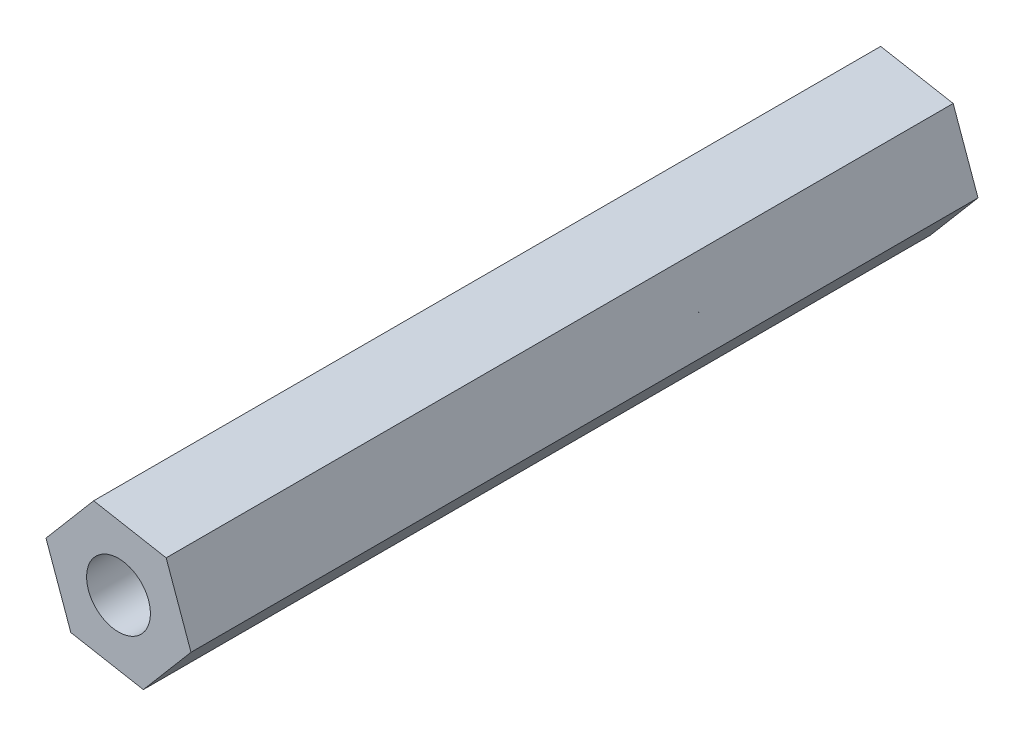
ISO-10303-21;
HEADER;
FILE_DESCRIPTION(('STEP AP214'),'2;1');
FILE_NAME('part.step','',(''),(''),'','','');
FILE_SCHEMA(('AUTOMOTIVE_DESIGN { 1 0 10303 214 1 1 1 1 }'));
ENDSEC;
DATA;
#1=APPLICATION_CONTEXT('core data for automotive mechanical design processes');
#2=APPLICATION_PROTOCOL_DEFINITION('international standard','automotive_design',2000,#1);
#3=PRODUCT_CONTEXT('',#1,'mechanical');
#4=PRODUCT('Part','Part','',(#3));
#5=PRODUCT_RELATED_PRODUCT_CATEGORY('part','',(#4));
#6=PRODUCT_DEFINITION_FORMATION('','',#4);
#7=PRODUCT_DEFINITION_CONTEXT('part definition',#1,'design');
#8=PRODUCT_DEFINITION('design','',#6,#7);
#9=PRODUCT_DEFINITION_SHAPE('','',#8);
#10=(LENGTH_UNIT() NAMED_UNIT(*) SI_UNIT(.MILLI.,.METRE.));
#11=(NAMED_UNIT(*) PLANE_ANGLE_UNIT() SI_UNIT($,.RADIAN.));
#12=(NAMED_UNIT(*) SI_UNIT($,.STERADIAN.) SOLID_ANGLE_UNIT());
#13=UNCERTAINTY_MEASURE_WITH_UNIT(LENGTH_MEASURE(1.E-05),#10,'distance_accuracy_value','');
#14=(GEOMETRIC_REPRESENTATION_CONTEXT(3) GLOBAL_UNCERTAINTY_ASSIGNED_CONTEXT((#13)) GLOBAL_UNIT_ASSIGNED_CONTEXT((#10,
#11,#12)) REPRESENTATION_CONTEXT('',''));
#15=CARTESIAN_POINT('',(0.,0.,0.));
#16=DIRECTION('',(0.,0.,1.));
#17=DIRECTION('',(1.,0.,0.));
#18=AXIS2_PLACEMENT_3D('',#15,#16,#17);
#19=CARTESIAN_POINT('',(14.100105118259,-7.40552271774973,37.));
#20=DIRECTION('',(-0.941553473498977,-0.336863557753005,0.));
#21=DIRECTION('',(0.336863557753005,-0.941553473498977,0.));
#22=AXIS2_PLACEMENT_3D('',#19,#20,#21);
#23=PLANE('',#22);
#24=DIRECTION('',(-0.336863557753005,0.941553473498977,0.));
#25=VECTOR('',#24,1.);
#26=CARTESIAN_POINT('',(14.100105118259,-7.40552271774973,0.));
#27=LINE('',#26,#25);
#28=CARTESIAN_POINT('',(14.100105118259,-7.40552271774973,0.));
#29=VERTEX_POINT('',#28);
#30=CARTESIAN_POINT('',(12.9331755237658,-4.14388580946336,0.));
#31=VERTEX_POINT('',#30);
#32=EDGE_CURVE('E117',#29,#31,#27,.T.);
#33=ORIENTED_EDGE('',*,*,#32,.T.);
#34=DIRECTION('',(0.,0.,-1.));
#35=VECTOR('',#34,1.);
#36=CARTESIAN_POINT('',(12.9331755237658,-4.14388580946336,37.));
#37=LINE('',#36,#35);
#38=CARTESIAN_POINT('',(12.9331755237658,-4.14388580946336,37.));
#39=VERTEX_POINT('',#38);
#40=EDGE_CURVE('E11',#39,#31,#37,.T.);
#41=ORIENTED_EDGE('',*,*,#40,.F.);
#42=DIRECTION('',(-0.336863557753005,0.941553473498977,0.));
#43=VECTOR('',#42,1.);
#44=CARTESIAN_POINT('',(14.100105118259,-7.40552271774973,37.));
#45=LINE('',#44,#43);
#46=CARTESIAN_POINT('',(14.100105118259,-7.40552271774973,37.));
#47=VERTEX_POINT('',#46);
#48=EDGE_CURVE('E128',#47,#39,#45,.T.);
#49=ORIENTED_EDGE('',*,*,#48,.F.);
#50=DIRECTION('',(0.,0.,-1.));
#51=VECTOR('',#50,1.);
#52=CARTESIAN_POINT('',(14.100105118259,-7.40552271774973,37.));
#53=LINE('',#52,#51);
#54=EDGE_CURVE('E113',#47,#29,#53,.T.);
#55=ORIENTED_EDGE('',*,*,#54,.T.);
#56=EDGE_LOOP('',(#33,#41,#49,#55));
#57=FACE_BOUND('',#56,.T.);
#58=ADVANCED_FACE('F33',(#57),#23,.F.);
#59=CARTESIAN_POINT('',(12.9331755237658,-4.14388580946336,37.));
#60=DIRECTION('',(-0.17904433812618,-0.983841005948094,0.));
#61=DIRECTION('',(0.983841005948094,-0.17904433812618,0.));
#62=AXIS2_PLACEMENT_3D('',#59,#60,#61);
#63=PLANE('',#62);
#64=DIRECTION('',(-0.983841005948094,0.17904433812618,0.));
#65=VECTOR('',#64,1.);
#66=CARTESIAN_POINT('',(12.9331755237658,-4.14388580946336,0.));
#67=LINE('',#66,#65);
#68=CARTESIAN_POINT('',(9.52505030602222,-3.52365802857919,0.));
#69=VERTEX_POINT('',#68);
#70=EDGE_CURVE('E120',#31,#69,#67,.T.);
#71=ORIENTED_EDGE('',*,*,#70,.T.);
#72=DIRECTION('',(0.,0.,-1.));
#73=VECTOR('',#72,1.);
#74=CARTESIAN_POINT('',(9.52505030602222,-3.52365802857919,37.));
#75=LINE('',#74,#73);
#76=CARTESIAN_POINT('',(9.52505030602222,-3.52365802857919,37.));
#77=VERTEX_POINT('',#76);
#78=EDGE_CURVE('E41',#77,#69,#75,.T.);
#79=ORIENTED_EDGE('',*,*,#78,.F.);
#80=DIRECTION('',(-0.983841005948094,0.17904433812618,0.));
#81=VECTOR('',#80,1.);
#82=CARTESIAN_POINT('',(12.9331755237658,-4.14388580946336,37.));
#83=LINE('',#82,#81);
#84=EDGE_CURVE('E86',#39,#77,#83,.T.);
#85=ORIENTED_EDGE('',*,*,#84,.F.);
#86=ORIENTED_EDGE('',*,*,#40,.T.);
#87=EDGE_LOOP('',(#71,#79,#85,#86));
#88=FACE_BOUND('',#87,.T.);
#89=ADVANCED_FACE('F153',(#88),#63,.F.);
#90=CARTESIAN_POINT('',(9.52505030602222,-3.52365802857919,37.));
#91=DIRECTION('',(0.762509135372797,-0.64697744819509,0.));
#92=DIRECTION('',(0.64697744819509,0.762509135372797,0.));
#93=AXIS2_PLACEMENT_3D('',#90,#91,#92);
#94=PLANE('',#93);
#95=DIRECTION('',(-0.64697744819509,-0.762509135372797,0.));
#96=VECTOR('',#95,1.);
#97=CARTESIAN_POINT('',(9.52505030602222,-3.52365802857919,0.));
#98=LINE('',#97,#96);
#99=CARTESIAN_POINT('',(7.28385468277191,-6.16506715598138,0.));
#100=VERTEX_POINT('',#99);
#101=EDGE_CURVE('E123',#69,#100,#98,.T.);
#102=ORIENTED_EDGE('',*,*,#101,.T.);
#103=DIRECTION('',(0.,0.,-1.));
#104=VECTOR('',#103,1.);
#105=CARTESIAN_POINT('',(7.28385468277191,-6.16506715598138,37.));
#106=LINE('',#105,#104);
#107=CARTESIAN_POINT('',(7.28385468277191,-6.16506715598138,37.));
#108=VERTEX_POINT('',#107);
#109=EDGE_CURVE('E108',#108,#100,#106,.T.);
#110=ORIENTED_EDGE('',*,*,#109,.F.);
#111=DIRECTION('',(-0.64697744819509,-0.762509135372797,0.));
#112=VECTOR('',#111,1.);
#113=CARTESIAN_POINT('',(9.52505030602222,-3.52365802857919,37.));
#114=LINE('',#113,#112);
#115=EDGE_CURVE('E99',#77,#108,#114,.T.);
#116=ORIENTED_EDGE('',*,*,#115,.F.);
#117=ORIENTED_EDGE('',*,*,#78,.T.);
#118=EDGE_LOOP('',(#102,#110,#116,#117));
#119=FACE_BOUND('',#118,.T.);
#120=ADVANCED_FACE('F134',(#119),#94,.F.);
#121=CARTESIAN_POINT('',(7.28385468277191,-6.16506715598138,37.));
#122=DIRECTION('',(0.941553473498977,0.336863557753005,0.));
#123=DIRECTION('',(-0.336863557753005,0.941553473498977,0.));
#124=AXIS2_PLACEMENT_3D('',#121,#122,#123);
#125=PLANE('',#124);
#126=DIRECTION('',(0.336863557753005,-0.941553473498977,0.));
#127=VECTOR('',#126,1.);
#128=CARTESIAN_POINT('',(7.28385468277191,-6.16506715598138,0.));
#129=LINE('',#128,#127);
#130=CARTESIAN_POINT('',(8.45078427726515,-9.42670406426776,0.));
#131=VERTEX_POINT('',#130);
#132=EDGE_CURVE('E107',#100,#131,#129,.T.);
#133=ORIENTED_EDGE('',*,*,#132,.T.);
#134=DIRECTION('',(0.,0.,-1.));
#135=VECTOR('',#134,1.);
#136=CARTESIAN_POINT('',(8.45078427726515,-9.42670406426776,37.));
#137=LINE('',#136,#135);
#138=CARTESIAN_POINT('',(8.45078427726515,-9.42670406426776,37.));
#139=VERTEX_POINT('',#138);
#140=EDGE_CURVE('E104',#139,#131,#137,.T.);
#141=ORIENTED_EDGE('',*,*,#140,.F.);
#142=DIRECTION('',(0.336863557753005,-0.941553473498977,0.));
#143=VECTOR('',#142,1.);
#144=CARTESIAN_POINT('',(7.28385468277191,-6.16506715598138,37.));
#145=LINE('',#144,#143);
#146=EDGE_CURVE('E93',#108,#139,#145,.T.);
#147=ORIENTED_EDGE('',*,*,#146,.F.);
#148=ORIENTED_EDGE('',*,*,#109,.T.);
#149=EDGE_LOOP('',(#133,#141,#147,#148));
#150=FACE_BOUND('',#149,.T.);
#151=ADVANCED_FACE('F105',(#150),#125,.F.);
#152=CARTESIAN_POINT('',(8.45078427726515,-9.42670406426776,37.));
#153=DIRECTION('',(0.17904433812618,0.983841005948094,0.));
#154=DIRECTION('',(-0.983841005948094,0.17904433812618,0.));
#155=AXIS2_PLACEMENT_3D('',#152,#153,#154);
#156=PLANE('',#155);
#157=DIRECTION('',(0.983841005948094,-0.17904433812618,0.));
#158=VECTOR('',#157,1.);
#159=CARTESIAN_POINT('',(8.45078427726515,-9.42670406426776,0.));
#160=LINE('',#159,#158);
#161=CARTESIAN_POINT('',(11.8589094950087,-10.0469318451519,0.));
#162=VERTEX_POINT('',#161);
#163=EDGE_CURVE('E72',#131,#162,#160,.T.);
#164=ORIENTED_EDGE('',*,*,#163,.T.);
#165=DIRECTION('',(0.,0.,-1.));
#166=VECTOR('',#165,1.);
#167=CARTESIAN_POINT('',(11.8589094950087,-10.0469318451519,37.));
#168=LINE('',#167,#166);
#169=CARTESIAN_POINT('',(11.8589094950087,-10.0469318451519,37.));
#170=VERTEX_POINT('',#169);
#171=EDGE_CURVE('E109',#170,#162,#168,.T.);
#172=ORIENTED_EDGE('',*,*,#171,.F.);
#173=DIRECTION('',(0.983841005948094,-0.17904433812618,0.));
#174=VECTOR('',#173,1.);
#175=CARTESIAN_POINT('',(8.45078427726515,-9.42670406426776,37.));
#176=LINE('',#175,#174);
#177=EDGE_CURVE('E97',#139,#170,#176,.T.);
#178=ORIENTED_EDGE('',*,*,#177,.F.);
#179=ORIENTED_EDGE('',*,*,#140,.T.);
#180=EDGE_LOOP('',(#164,#172,#178,#179));
#181=FACE_BOUND('',#180,.T.);
#182=ADVANCED_FACE('F111',(#181),#156,.F.);
#183=CARTESIAN_POINT('',(11.8589094950087,-10.0469318451519,37.));
#184=DIRECTION('',(-0.762509135372797,0.64697744819509,0.));
#185=DIRECTION('',(-0.64697744819509,-0.762509135372797,0.));
#186=AXIS2_PLACEMENT_3D('',#183,#184,#185);
#187=PLANE('',#186);
#188=DIRECTION('',(0.64697744819509,0.762509135372797,0.));
#189=VECTOR('',#188,1.);
#190=CARTESIAN_POINT('',(11.8589094950087,-10.0469318451519,0.));
#191=LINE('',#190,#189);
#192=EDGE_CURVE('E78',#162,#29,#191,.T.);
#193=ORIENTED_EDGE('',*,*,#192,.T.);
#194=ORIENTED_EDGE('',*,*,#54,.F.);
#195=DIRECTION('',(0.64697744819509,0.762509135372797,0.));
#196=VECTOR('',#195,1.);
#197=CARTESIAN_POINT('',(11.8589094950087,-10.0469318451519,37.));
#198=LINE('',#197,#196);
#199=EDGE_CURVE('E49',#170,#47,#198,.T.);
#200=ORIENTED_EDGE('',*,*,#199,.F.);
#201=ORIENTED_EDGE('',*,*,#171,.T.);
#202=EDGE_LOOP('',(#193,#194,#200,#201));
#203=FACE_BOUND('',#202,.T.);
#204=ADVANCED_FACE('F141',(#203),#187,.F.);
#205=CARTESIAN_POINT('',(0.,0.,37.));
#206=DIRECTION('',(0.,0.,1.));
#207=DIRECTION('',(1.,0.,0.));
#208=AXIS2_PLACEMENT_3D('',#205,#206,#207);
#209=PLANE('',#208);
#210=CARTESIAN_POINT('',(10.6919799005155,-6.78529493686556,37.));
#211=DIRECTION('',(0.,0.,1.));
#212=DIRECTION('',(1.,0.,0.));
#213=AXIS2_PLACEMENT_3D('',#210,#211,#212);
#214=CIRCLE('',#213,1.5);
#215=CARTESIAN_POINT('',(12.1919799005155,-6.78529493686556,37.));
#216=VERTEX_POINT('',#215);
#217=EDGE_CURVE('E121',#216,#216,#214,.T.);
#218=ORIENTED_EDGE('',*,*,#217,.F.);
#219=EDGE_LOOP('',(#218));
#220=FACE_BOUND('',#219,.T.);
#221=ORIENTED_EDGE('',*,*,#48,.T.);
#222=ORIENTED_EDGE('',*,*,#84,.T.);
#223=ORIENTED_EDGE('',*,*,#115,.T.);
#224=ORIENTED_EDGE('',*,*,#146,.T.);
#225=ORIENTED_EDGE('',*,*,#177,.T.);
#226=ORIENTED_EDGE('',*,*,#199,.T.);
#227=EDGE_LOOP('',(#221,#222,#223,#224,#225,#226));
#228=FACE_BOUND('',#227,.T.);
#229=ADVANCED_FACE('F95',(#220,#228),#209,.T.);
#230=CARTESIAN_POINT('',(0.,0.,0.));
#231=DIRECTION('',(0.,0.,1.));
#232=DIRECTION('',(1.,0.,0.));
#233=AXIS2_PLACEMENT_3D('',#230,#231,#232);
#234=PLANE('',#233);
#235=CARTESIAN_POINT('',(10.6919799005155,-6.78529493686556,0.));
#236=DIRECTION('',(0.,0.,-1.));
#237=DIRECTION('',(-1.,0.,0.));
#238=AXIS2_PLACEMENT_3D('',#235,#236,#237);
#239=CIRCLE('',#238,1.5);
#240=CARTESIAN_POINT('',(9.19197990051546,-6.78529493686556,0.));
#241=VERTEX_POINT('',#240);
#242=EDGE_CURVE('E208',#241,#241,#239,.T.);
#243=ORIENTED_EDGE('',*,*,#242,.F.);
#244=EDGE_LOOP('',(#243));
#245=FACE_BOUND('',#244,.T.);
#246=ORIENTED_EDGE('',*,*,#32,.F.);
#247=ORIENTED_EDGE('',*,*,#192,.F.);
#248=ORIENTED_EDGE('',*,*,#163,.F.);
#249=ORIENTED_EDGE('',*,*,#132,.F.);
#250=ORIENTED_EDGE('',*,*,#101,.F.);
#251=ORIENTED_EDGE('',*,*,#70,.F.);
#252=EDGE_LOOP('',(#246,#247,#248,#249,#250,#251));
#253=FACE_BOUND('',#252,.T.);
#254=ADVANCED_FACE('F137',(#245,#253),#234,.F.);
#255=CARTESIAN_POINT('',(10.6919799005155,-6.78529493686556,40.));
#256=DIRECTION('',(0.,0.,-1.));
#257=DIRECTION('',(-1.,0.,0.));
#258=AXIS2_PLACEMENT_3D('',#255,#256,#257);
#259=CYLINDRICAL_SURFACE('',#258,1.5);
#260=ORIENTED_EDGE('',*,*,#217,.T.);
#261=EDGE_LOOP('',(#260));
#262=FACE_BOUND('',#261,.T.);
#263=ORIENTED_EDGE('',*,*,#242,.T.);
#264=EDGE_LOOP('',(#263));
#265=FACE_BOUND('',#264,.T.);
#266=ADVANCED_FACE('F190',(#262,#265),#259,.F.);
#267=CLOSED_SHELL('',(#58,#89,#120,#151,#182,#204,#229,#254,#266));
#268=MANIFOLD_SOLID_BREP('B2',#267);
#269=ADVANCED_BREP_SHAPE_REPRESENTATION('',(#18,#268),#14);
#270=SHAPE_DEFINITION_REPRESENTATION(#9,#269);
ENDSEC;
END-ISO-10303-21;
